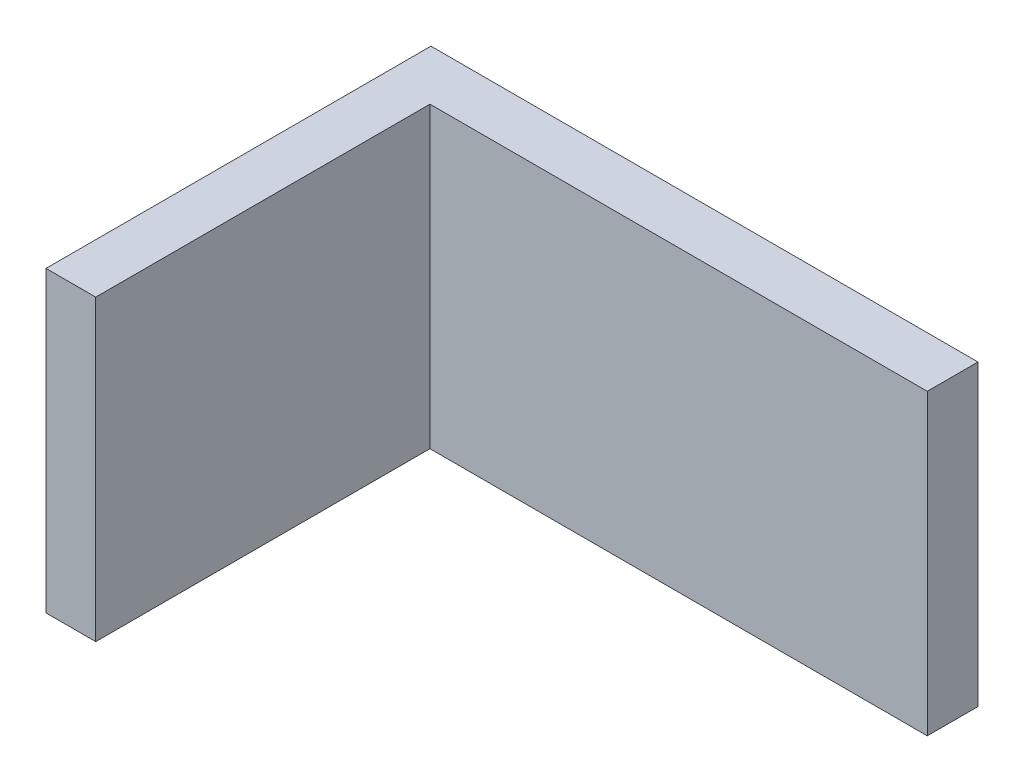
ISO-10303-21;
HEADER;
FILE_DESCRIPTION(('STEP AP214'),'2;1');
FILE_NAME('part.step','',(''),(''),'','','');
FILE_SCHEMA(('AUTOMOTIVE_DESIGN { 1 0 10303 214 1 1 1 1 }'));
ENDSEC;
DATA;
#1=APPLICATION_CONTEXT('core data for automotive mechanical design processes');
#2=APPLICATION_PROTOCOL_DEFINITION('international standard','automotive_design',2000,#1);
#3=PRODUCT_CONTEXT('',#1,'mechanical');
#4=PRODUCT('Part','Part','',(#3));
#5=PRODUCT_RELATED_PRODUCT_CATEGORY('part','',(#4));
#6=PRODUCT_DEFINITION_FORMATION('','',#4);
#7=PRODUCT_DEFINITION_CONTEXT('part definition',#1,'design');
#8=PRODUCT_DEFINITION('design','',#6,#7);
#9=PRODUCT_DEFINITION_SHAPE('','',#8);
#10=(LENGTH_UNIT() NAMED_UNIT(*) SI_UNIT(.MILLI.,.METRE.));
#11=(NAMED_UNIT(*) PLANE_ANGLE_UNIT() SI_UNIT($,.RADIAN.));
#12=(NAMED_UNIT(*) SI_UNIT($,.STERADIAN.) SOLID_ANGLE_UNIT());
#13=UNCERTAINTY_MEASURE_WITH_UNIT(LENGTH_MEASURE(1.E-05),#10,'distance_accuracy_value','');
#14=(GEOMETRIC_REPRESENTATION_CONTEXT(3) GLOBAL_UNCERTAINTY_ASSIGNED_CONTEXT((#13)) GLOBAL_UNIT_ASSIGNED_CONTEXT((#10,
#11,#12)) REPRESENTATION_CONTEXT('',''));
#15=CARTESIAN_POINT('',(0.,0.,0.));
#16=DIRECTION('',(0.,0.,1.));
#17=DIRECTION('',(1.,0.,0.));
#18=AXIS2_PLACEMENT_3D('',#15,#16,#17);
#19=CARTESIAN_POINT('',(-4.55,0.1,0.));
#20=DIRECTION('',(0.,-1.,0.));
#21=DIRECTION('',(0.,0.,1.));
#22=AXIS2_PLACEMENT_3D('',#19,#20,#21);
#23=PLANE('',#22);
#24=DIRECTION('',(-1.,0.,0.));
#25=VECTOR('',#24,1.);
#26=CARTESIAN_POINT('',(-4.,0.1,0.));
#27=LINE('',#26,#25);
#28=CARTESIAN_POINT('',(-4.,0.1,0.));
#29=VERTEX_POINT('',#28);
#30=CARTESIAN_POINT('',(-4.55,0.1,0.));
#31=VERTEX_POINT('',#30);
#32=EDGE_CURVE('E11',#29,#31,#27,.T.);
#33=ORIENTED_EDGE('',*,*,#32,.F.);
#34=DIRECTION('',(0.,0.,-1.));
#35=VECTOR('',#34,1.);
#36=CARTESIAN_POINT('',(-4.,0.1,0.051));
#37=LINE('',#36,#35);
#38=CARTESIAN_POINT('',(-4.,0.1,0.051));
#39=VERTEX_POINT('',#38);
#40=EDGE_CURVE('E24',#39,#29,#37,.T.);
#41=ORIENTED_EDGE('',*,*,#40,.F.);
#42=DIRECTION('',(1.,0.,0.));
#43=VECTOR('',#42,1.);
#44=CARTESIAN_POINT('',(-4.5,0.1,0.051));
#45=LINE('',#44,#43);
#46=CARTESIAN_POINT('',(-4.5,0.1,0.051));
#47=VERTEX_POINT('',#46);
#48=EDGE_CURVE('E87',#47,#39,#45,.T.);
#49=ORIENTED_EDGE('',*,*,#48,.F.);
#50=DIRECTION('',(0.,0.,-1.));
#51=VECTOR('',#50,1.);
#52=CARTESIAN_POINT('',(-4.5,0.1,0.387));
#53=LINE('',#52,#51);
#54=CARTESIAN_POINT('',(-4.5,0.1,0.387));
#55=VERTEX_POINT('',#54);
#56=EDGE_CURVE('E114',#55,#47,#53,.T.);
#57=ORIENTED_EDGE('',*,*,#56,.F.);
#58=DIRECTION('',(1.,0.,0.));
#59=VECTOR('',#58,1.);
#60=CARTESIAN_POINT('',(-4.55,0.1,0.387));
#61=LINE('',#60,#59);
#62=CARTESIAN_POINT('',(-4.55,0.1,0.387));
#63=VERTEX_POINT('',#62);
#64=EDGE_CURVE('E111',#63,#55,#61,.T.);
#65=ORIENTED_EDGE('',*,*,#64,.F.);
#66=DIRECTION('',(0.,0.,1.));
#67=VECTOR('',#66,1.);
#68=CARTESIAN_POINT('',(-4.55,0.1,0.));
#69=LINE('',#68,#67);
#70=EDGE_CURVE('E108',#31,#63,#69,.T.);
#71=ORIENTED_EDGE('',*,*,#70,.F.);
#72=EDGE_LOOP('',(#33,#41,#49,#57,#65,#71));
#73=FACE_BOUND('',#72,.T.);
#74=ADVANCED_FACE('F17',(#73),#23,.T.);
#75=CARTESIAN_POINT('',(-4.,0.4,0.));
#76=DIRECTION('',(0.,1.,0.));
#77=DIRECTION('',(0.,0.,1.));
#78=AXIS2_PLACEMENT_3D('',#75,#76,#77);
#79=PLANE('',#78);
#80=DIRECTION('',(1.,0.,0.));
#81=VECTOR('',#80,1.);
#82=CARTESIAN_POINT('',(-4.55,0.4,0.));
#83=LINE('',#82,#81);
#84=CARTESIAN_POINT('',(-4.55,0.4,0.));
#85=VERTEX_POINT('',#84);
#86=CARTESIAN_POINT('',(-4.,0.4,0.));
#87=VERTEX_POINT('',#86);
#88=EDGE_CURVE('E106',#85,#87,#83,.T.);
#89=ORIENTED_EDGE('',*,*,#88,.F.);
#90=DIRECTION('',(0.,0.,-1.));
#91=VECTOR('',#90,1.);
#92=CARTESIAN_POINT('',(-4.55,0.4,0.387));
#93=LINE('',#92,#91);
#94=CARTESIAN_POINT('',(-4.55,0.4,0.387));
#95=VERTEX_POINT('',#94);
#96=EDGE_CURVE('E103',#95,#85,#93,.T.);
#97=ORIENTED_EDGE('',*,*,#96,.F.);
#98=DIRECTION('',(-1.,0.,0.));
#99=VECTOR('',#98,1.);
#100=CARTESIAN_POINT('',(-4.5,0.4,0.387));
#101=LINE('',#100,#99);
#102=CARTESIAN_POINT('',(-4.5,0.4,0.387));
#103=VERTEX_POINT('',#102);
#104=EDGE_CURVE('E100',#103,#95,#101,.T.);
#105=ORIENTED_EDGE('',*,*,#104,.F.);
#106=DIRECTION('',(0.,0.,1.));
#107=VECTOR('',#106,1.);
#108=CARTESIAN_POINT('',(-4.5,0.4,0.051));
#109=LINE('',#108,#107);
#110=CARTESIAN_POINT('',(-4.5,0.4,0.051));
#111=VERTEX_POINT('',#110);
#112=EDGE_CURVE('E72',#111,#103,#109,.T.);
#113=ORIENTED_EDGE('',*,*,#112,.F.);
#114=DIRECTION('',(-1.,0.,0.));
#115=VECTOR('',#114,1.);
#116=CARTESIAN_POINT('',(-4.,0.4,0.051));
#117=LINE('',#116,#115);
#118=CARTESIAN_POINT('',(-4.,0.4,0.051));
#119=VERTEX_POINT('',#118);
#120=EDGE_CURVE('E66',#119,#111,#117,.T.);
#121=ORIENTED_EDGE('',*,*,#120,.F.);
#122=DIRECTION('',(0.,0.,1.));
#123=VECTOR('',#122,1.);
#124=CARTESIAN_POINT('',(-4.,0.4,0.));
#125=LINE('',#124,#123);
#126=EDGE_CURVE('E69',#87,#119,#125,.T.);
#127=ORIENTED_EDGE('',*,*,#126,.F.);
#128=EDGE_LOOP('',(#89,#97,#105,#113,#121,#127));
#129=FACE_BOUND('',#128,.T.);
#130=ADVANCED_FACE('F68',(#129),#79,.T.);
#131=CARTESIAN_POINT('',(-4.55,0.1,0.387));
#132=DIRECTION('',(0.,0.,1.));
#133=DIRECTION('',(0.,1.,0.));
#134=AXIS2_PLACEMENT_3D('',#131,#132,#133);
#135=PLANE('',#134);
#136=ORIENTED_EDGE('',*,*,#64,.T.);
#137=DIRECTION('',(0.,-1.,0.));
#138=VECTOR('',#137,1.);
#139=CARTESIAN_POINT('',(-4.5,0.4,0.387));
#140=LINE('',#139,#138);
#141=EDGE_CURVE('E83',#103,#55,#140,.T.);
#142=ORIENTED_EDGE('',*,*,#141,.F.);
#143=ORIENTED_EDGE('',*,*,#104,.T.);
#144=DIRECTION('',(0.,1.,0.));
#145=VECTOR('',#144,1.);
#146=CARTESIAN_POINT('',(-4.55,0.1,0.387));
#147=LINE('',#146,#145);
#148=EDGE_CURVE('E88',#63,#95,#147,.T.);
#149=ORIENTED_EDGE('',*,*,#148,.F.);
#150=EDGE_LOOP('',(#136,#142,#143,#149));
#151=FACE_BOUND('',#150,.T.);
#152=ADVANCED_FACE('F125',(#151),#135,.T.);
#153=CARTESIAN_POINT('',(-4.5,0.1,0.051));
#154=DIRECTION('',(0.,0.,1.));
#155=DIRECTION('',(0.,1.,0.));
#156=AXIS2_PLACEMENT_3D('',#153,#154,#155);
#157=PLANE('',#156);
#158=ORIENTED_EDGE('',*,*,#48,.T.);
#159=DIRECTION('',(0.,-1.,0.));
#160=VECTOR('',#159,1.);
#161=CARTESIAN_POINT('',(-4.,0.4,0.051));
#162=LINE('',#161,#160);
#163=EDGE_CURVE('E81',#119,#39,#162,.T.);
#164=ORIENTED_EDGE('',*,*,#163,.F.);
#165=ORIENTED_EDGE('',*,*,#120,.T.);
#166=DIRECTION('',(0.,1.,0.));
#167=VECTOR('',#166,1.);
#168=CARTESIAN_POINT('',(-4.5,0.1,0.051));
#169=LINE('',#168,#167);
#170=EDGE_CURVE('E89',#47,#111,#169,.T.);
#171=ORIENTED_EDGE('',*,*,#170,.F.);
#172=EDGE_LOOP('',(#158,#164,#165,#171));
#173=FACE_BOUND('',#172,.T.);
#174=ADVANCED_FACE('F86',(#173),#157,.T.);
#175=CARTESIAN_POINT('',(-4.55,0.4,0.));
#176=DIRECTION('',(-1.,0.,0.));
#177=DIRECTION('',(0.,0.,1.));
#178=AXIS2_PLACEMENT_3D('',#175,#176,#177);
#179=PLANE('',#178);
#180=DIRECTION('',(0.,1.,0.));
#181=VECTOR('',#180,1.);
#182=CARTESIAN_POINT('',(-4.55,0.1,0.));
#183=LINE('',#182,#181);
#184=EDGE_CURVE('E93',#31,#85,#183,.T.);
#185=ORIENTED_EDGE('',*,*,#184,.F.);
#186=ORIENTED_EDGE('',*,*,#70,.T.);
#187=ORIENTED_EDGE('',*,*,#148,.T.);
#188=ORIENTED_EDGE('',*,*,#96,.T.);
#189=EDGE_LOOP('',(#185,#186,#187,#188));
#190=FACE_BOUND('',#189,.T.);
#191=ADVANCED_FACE('F121',(#190),#179,.T.);
#192=CARTESIAN_POINT('',(-4.,0.1,0.));
#193=DIRECTION('',(1.,0.,0.));
#194=DIRECTION('',(0.,0.,1.));
#195=AXIS2_PLACEMENT_3D('',#192,#193,#194);
#196=PLANE('',#195);
#197=DIRECTION('',(0.,-1.,0.));
#198=VECTOR('',#197,1.);
#199=CARTESIAN_POINT('',(-4.,0.4,0.));
#200=LINE('',#199,#198);
#201=EDGE_CURVE('E82',#87,#29,#200,.T.);
#202=ORIENTED_EDGE('',*,*,#201,.F.);
#203=ORIENTED_EDGE('',*,*,#126,.T.);
#204=ORIENTED_EDGE('',*,*,#163,.T.);
#205=ORIENTED_EDGE('',*,*,#40,.T.);
#206=EDGE_LOOP('',(#202,#203,#204,#205));
#207=FACE_BOUND('',#206,.T.);
#208=ADVANCED_FACE('F80',(#207),#196,.T.);
#209=CARTESIAN_POINT('',(-4.5,0.1,0.051));
#210=DIRECTION('',(1.,0.,0.));
#211=DIRECTION('',(0.,0.,1.));
#212=AXIS2_PLACEMENT_3D('',#209,#210,#211);
#213=PLANE('',#212);
#214=ORIENTED_EDGE('',*,*,#170,.T.);
#215=ORIENTED_EDGE('',*,*,#112,.T.);
#216=ORIENTED_EDGE('',*,*,#141,.T.);
#217=ORIENTED_EDGE('',*,*,#56,.T.);
#218=EDGE_LOOP('',(#214,#215,#216,#217));
#219=FACE_BOUND('',#218,.T.);
#220=ADVANCED_FACE('F127',(#219),#213,.T.);
#221=CARTESIAN_POINT('',(-4.55,0.4,0.));
#222=DIRECTION('',(0.,0.,-1.));
#223=DIRECTION('',(0.,1.,0.));
#224=AXIS2_PLACEMENT_3D('',#221,#222,#223);
#225=PLANE('',#224);
#226=ORIENTED_EDGE('',*,*,#88,.T.);
#227=ORIENTED_EDGE('',*,*,#201,.T.);
#228=ORIENTED_EDGE('',*,*,#32,.T.);
#229=ORIENTED_EDGE('',*,*,#184,.T.);
#230=EDGE_LOOP('',(#226,#227,#228,#229));
#231=FACE_BOUND('',#230,.T.);
#232=ADVANCED_FACE('F117',(#231),#225,.T.);
#233=CLOSED_SHELL('',(#74,#130,#152,#174,#191,#208,#220,#232));
#234=MANIFOLD_SOLID_BREP('B1',#233);
#235=ADVANCED_BREP_SHAPE_REPRESENTATION('',(#18,#234),#14);
#236=SHAPE_DEFINITION_REPRESENTATION(#9,#235);
ENDSEC;
END-ISO-10303-21;
